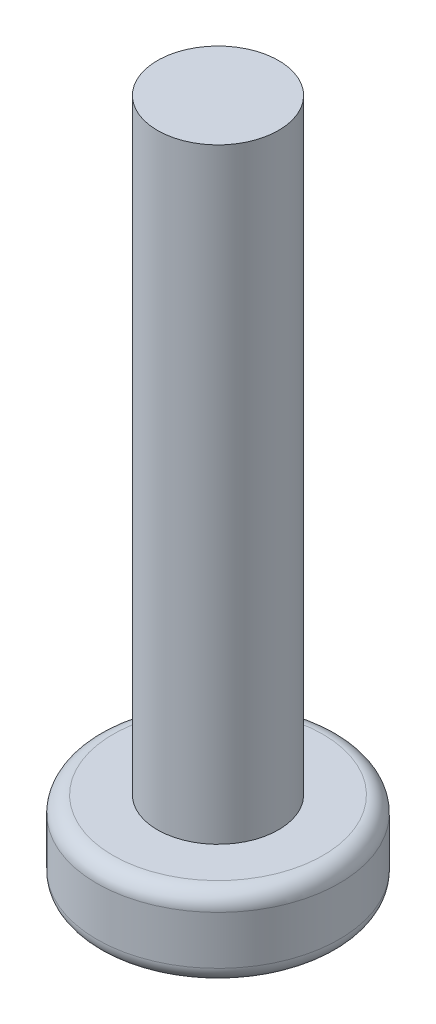
ISO-10303-21;
HEADER;
FILE_DESCRIPTION(('STEP AP214'),'2;1');
FILE_NAME('part.step','',(''),(''),'','','');
FILE_SCHEMA(('AUTOMOTIVE_DESIGN { 1 0 10303 214 1 1 1 1 }'));
ENDSEC;
DATA;
#1=APPLICATION_CONTEXT('core data for automotive mechanical design processes');
#2=APPLICATION_PROTOCOL_DEFINITION('international standard','automotive_design',2000,#1);
#3=PRODUCT_CONTEXT('',#1,'mechanical');
#4=PRODUCT('Part','Part','',(#3));
#5=PRODUCT_RELATED_PRODUCT_CATEGORY('part','',(#4));
#6=PRODUCT_DEFINITION_FORMATION('','',#4);
#7=PRODUCT_DEFINITION_CONTEXT('part definition',#1,'design');
#8=PRODUCT_DEFINITION('design','',#6,#7);
#9=PRODUCT_DEFINITION_SHAPE('','',#8);
#10=(LENGTH_UNIT() NAMED_UNIT(*) SI_UNIT(.MILLI.,.METRE.));
#11=(NAMED_UNIT(*) PLANE_ANGLE_UNIT() SI_UNIT($,.RADIAN.));
#12=(NAMED_UNIT(*) SI_UNIT($,.STERADIAN.) SOLID_ANGLE_UNIT());
#13=UNCERTAINTY_MEASURE_WITH_UNIT(LENGTH_MEASURE(1.E-05),#10,'distance_accuracy_value','');
#14=(GEOMETRIC_REPRESENTATION_CONTEXT(3) GLOBAL_UNCERTAINTY_ASSIGNED_CONTEXT((#13)) GLOBAL_UNIT_ASSIGNED_CONTEXT((#10,
#11,#12)) REPRESENTATION_CONTEXT('',''));
#15=CARTESIAN_POINT('',(0.,0.,0.));
#16=DIRECTION('',(0.,0.,1.));
#17=DIRECTION('',(1.,0.,0.));
#18=AXIS2_PLACEMENT_3D('',#15,#16,#17);
#19=CARTESIAN_POINT('',(0.,2.,0.));
#20=DIRECTION('',(0.,1.,0.));
#21=DIRECTION('',(0.,0.,1.));
#22=AXIS2_PLACEMENT_3D('',#19,#20,#21);
#23=PLANE('',#22);
#24=CARTESIAN_POINT('',(0.,2.,0.));
#25=DIRECTION('',(0.,1.,0.));
#26=DIRECTION('',(0.,0.,1.));
#27=AXIS2_PLACEMENT_3D('',#24,#25,#26);
#28=CIRCLE('',#27,2.6);
#29=CARTESIAN_POINT('',(0.,2.,2.6));
#30=VERTEX_POINT('',#29);
#31=EDGE_CURVE('E213',#30,#30,#28,.T.);
#32=ORIENTED_EDGE('',*,*,#31,.T.);
#33=EDGE_LOOP('',(#32));
#34=FACE_BOUND('',#33,.T.);
#35=CARTESIAN_POINT('',(0.,2.,0.));
#36=DIRECTION('',(0.,1.,0.));
#37=DIRECTION('',(0.,0.,1.));
#38=AXIS2_PLACEMENT_3D('',#35,#36,#37);
#39=CIRCLE('',#38,1.5);
#40=CARTESIAN_POINT('',(0.,2.,1.5));
#41=VERTEX_POINT('',#40);
#42=EDGE_CURVE('E192',#41,#41,#39,.T.);
#43=ORIENTED_EDGE('',*,*,#42,.F.);
#44=EDGE_LOOP('',(#43));
#45=FACE_BOUND('',#44,.T.);
#46=ADVANCED_FACE('F33',(#34,#45),#23,.T.);
#47=CARTESIAN_POINT('',(0.,2.,0.));
#48=DIRECTION('',(0.,-1.,0.));
#49=DIRECTION('',(0.,0.,-1.));
#50=AXIS2_PLACEMENT_3D('',#47,#48,#49);
#51=CYLINDRICAL_SURFACE('',#50,3.);
#52=CARTESIAN_POINT('',(0.,1.6,0.));
#53=DIRECTION('',(0.,1.,0.));
#54=DIRECTION('',(0.,0.,1.));
#55=AXIS2_PLACEMENT_3D('',#52,#53,#54);
#56=CIRCLE('',#55,3.);
#57=CARTESIAN_POINT('',(0.,1.6,3.));
#58=VERTEX_POINT('',#57);
#59=EDGE_CURVE('E41',#58,#58,#56,.F.);
#60=ORIENTED_EDGE('',*,*,#59,.T.);
#61=EDGE_LOOP('',(#60));
#62=FACE_BOUND('',#61,.T.);
#63=CARTESIAN_POINT('',(0.,0.4,0.));
#64=DIRECTION('',(0.,1.,0.));
#65=DIRECTION('',(0.,0.,1.));
#66=AXIS2_PLACEMENT_3D('',#63,#64,#65);
#67=CIRCLE('',#66,3.);
#68=CARTESIAN_POINT('',(0.,0.4,3.));
#69=VERTEX_POINT('',#68);
#70=EDGE_CURVE('E218',#69,#69,#67,.T.);
#71=ORIENTED_EDGE('',*,*,#70,.T.);
#72=EDGE_LOOP('',(#71));
#73=FACE_BOUND('',#72,.T.);
#74=ADVANCED_FACE('F223',(#62,#73),#51,.T.);
#75=CARTESIAN_POINT('',(0.,0.,0.));
#76=DIRECTION('',(0.,1.,0.));
#77=DIRECTION('',(0.,0.,1.));
#78=AXIS2_PLACEMENT_3D('',#75,#76,#77);
#79=PLANE('',#78);
#80=CARTESIAN_POINT('',(0.,0.,0.));
#81=DIRECTION('',(0.,1.,0.));
#82=DIRECTION('',(0.,0.,1.));
#83=AXIS2_PLACEMENT_3D('',#80,#81,#82);
#84=CIRCLE('',#83,2.6);
#85=CARTESIAN_POINT('',(0.,0.,2.6));
#86=VERTEX_POINT('',#85);
#87=EDGE_CURVE('E11',#86,#86,#84,.F.);
#88=ORIENTED_EDGE('',*,*,#87,.T.);
#89=EDGE_LOOP('',(#88));
#90=FACE_BOUND('',#89,.T.);
#91=DIRECTION('',(1.,0.,0.));
#92=VECTOR('',#91,1.);
#93=CARTESIAN_POINT('',(0.,0.,0.45));
#94=LINE('',#93,#92);
#95=CARTESIAN_POINT('',(-1.5,0.,0.45));
#96=VERTEX_POINT('',#95);
#97=CARTESIAN_POINT('',(-0.45,0.,0.45));
#98=VERTEX_POINT('',#97);
#99=EDGE_CURVE('E160',#96,#98,#94,.T.);
#100=ORIENTED_EDGE('',*,*,#99,.T.);
#101=DIRECTION('',(0.,0.,-1.));
#102=VECTOR('',#101,1.);
#103=CARTESIAN_POINT('',(-0.45,0.,0.));
#104=LINE('',#103,#102);
#105=CARTESIAN_POINT('',(-0.45,0.,1.5));
#106=VERTEX_POINT('',#105);
#107=EDGE_CURVE('E48',#106,#98,#104,.T.);
#108=ORIENTED_EDGE('',*,*,#107,.F.);
#109=DIRECTION('',(1.,0.,0.));
#110=VECTOR('',#109,1.);
#111=CARTESIAN_POINT('',(0.,0.,1.5));
#112=LINE('',#111,#110);
#113=CARTESIAN_POINT('',(0.45,0.,1.5));
#114=VERTEX_POINT('',#113);
#115=EDGE_CURVE('E187',#106,#114,#112,.T.);
#116=ORIENTED_EDGE('',*,*,#115,.T.);
#117=DIRECTION('',(0.,0.,-1.));
#118=VECTOR('',#117,1.);
#119=CARTESIAN_POINT('',(0.45,0.,0.));
#120=LINE('',#119,#118);
#121=CARTESIAN_POINT('',(0.45,0.,0.45));
#122=VERTEX_POINT('',#121);
#123=EDGE_CURVE('E185',#114,#122,#120,.T.);
#124=ORIENTED_EDGE('',*,*,#123,.T.);
#125=DIRECTION('',(1.,0.,0.));
#126=VECTOR('',#125,1.);
#127=CARTESIAN_POINT('',(0.,0.,0.45));
#128=LINE('',#127,#126);
#129=CARTESIAN_POINT('',(1.5,0.,0.45));
#130=VERTEX_POINT('',#129);
#131=EDGE_CURVE('E143',#122,#130,#128,.T.);
#132=ORIENTED_EDGE('',*,*,#131,.T.);
#133=DIRECTION('',(0.,0.,-1.));
#134=VECTOR('',#133,1.);
#135=CARTESIAN_POINT('',(1.5,0.,0.));
#136=LINE('',#135,#134);
#137=CARTESIAN_POINT('',(1.5,0.,-0.45));
#138=VERTEX_POINT('',#137);
#139=EDGE_CURVE('E181',#130,#138,#136,.T.);
#140=ORIENTED_EDGE('',*,*,#139,.T.);
#141=DIRECTION('',(1.,0.,0.));
#142=VECTOR('',#141,1.);
#143=CARTESIAN_POINT('',(0.,0.,-0.45));
#144=LINE('',#143,#142);
#145=CARTESIAN_POINT('',(0.45,0.,-0.45));
#146=VERTEX_POINT('',#145);
#147=EDGE_CURVE('E178',#146,#138,#144,.T.);
#148=ORIENTED_EDGE('',*,*,#147,.F.);
#149=DIRECTION('',(0.,0.,-1.));
#150=VECTOR('',#149,1.);
#151=CARTESIAN_POINT('',(0.45,0.,0.));
#152=LINE('',#151,#150);
#153=CARTESIAN_POINT('',(0.45,0.,-1.5));
#154=VERTEX_POINT('',#153);
#155=EDGE_CURVE('E175',#146,#154,#152,.T.);
#156=ORIENTED_EDGE('',*,*,#155,.T.);
#157=DIRECTION('',(1.,0.,0.));
#158=VECTOR('',#157,1.);
#159=CARTESIAN_POINT('',(0.,0.,-1.5));
#160=LINE('',#159,#158);
#161=CARTESIAN_POINT('',(-0.45,0.,-1.5));
#162=VERTEX_POINT('',#161);
#163=EDGE_CURVE('E172',#162,#154,#160,.T.);
#164=ORIENTED_EDGE('',*,*,#163,.F.);
#165=DIRECTION('',(0.,0.,-1.));
#166=VECTOR('',#165,1.);
#167=CARTESIAN_POINT('',(-0.45,0.,0.));
#168=LINE('',#167,#166);
#169=CARTESIAN_POINT('',(-0.45,0.,-0.45));
#170=VERTEX_POINT('',#169);
#171=EDGE_CURVE('E169',#170,#162,#168,.T.);
#172=ORIENTED_EDGE('',*,*,#171,.F.);
#173=DIRECTION('',(1.,0.,0.));
#174=VECTOR('',#173,1.);
#175=CARTESIAN_POINT('',(0.,0.,-0.45));
#176=LINE('',#175,#174);
#177=CARTESIAN_POINT('',(-1.5,0.,-0.45));
#178=VERTEX_POINT('',#177);
#179=EDGE_CURVE('E166',#178,#170,#176,.T.);
#180=ORIENTED_EDGE('',*,*,#179,.F.);
#181=DIRECTION('',(0.,0.,-1.));
#182=VECTOR('',#181,1.);
#183=CARTESIAN_POINT('',(-1.5,0.,0.));
#184=LINE('',#183,#182);
#185=EDGE_CURVE('E163',#96,#178,#184,.T.);
#186=ORIENTED_EDGE('',*,*,#185,.F.);
#187=EDGE_LOOP('',(#100,#108,#116,#124,#132,#140,#148,#156,#164,#172,#180,#186));
#188=FACE_BOUND('',#187,.T.);
#189=ADVANCED_FACE('F239',(#90,#188),#79,.F.);
#190=CARTESIAN_POINT('',(0.,17.,0.));
#191=DIRECTION('',(0.,-1.,0.));
#192=DIRECTION('',(0.,0.,-1.));
#193=AXIS2_PLACEMENT_3D('',#190,#191,#192);
#194=CYLINDRICAL_SURFACE('',#193,1.5);
#195=CARTESIAN_POINT('',(0.,17.,0.));
#196=DIRECTION('',(0.,1.,0.));
#197=DIRECTION('',(0.,0.,1.));
#198=AXIS2_PLACEMENT_3D('',#195,#196,#197);
#199=CIRCLE('',#198,1.5);
#200=CARTESIAN_POINT('',(0.,17.,1.5));
#201=VERTEX_POINT('',#200);
#202=EDGE_CURVE('E210',#201,#201,#199,.T.);
#203=ORIENTED_EDGE('',*,*,#202,.F.);
#204=EDGE_LOOP('',(#203));
#205=FACE_BOUND('',#204,.T.);
#206=ORIENTED_EDGE('',*,*,#42,.T.);
#207=EDGE_LOOP('',(#206));
#208=FACE_BOUND('',#207,.T.);
#209=ADVANCED_FACE('F236',(#205,#208),#194,.T.);
#210=CARTESIAN_POINT('',(0.,17.,0.));
#211=DIRECTION('',(0.,1.,0.));
#212=DIRECTION('',(0.,0.,1.));
#213=AXIS2_PLACEMENT_3D('',#210,#211,#212);
#214=PLANE('',#213);
#215=ORIENTED_EDGE('',*,*,#202,.T.);
#216=EDGE_LOOP('',(#215));
#217=FACE_BOUND('',#216,.T.);
#218=ADVANCED_FACE('F238',(#217),#214,.T.);
#219=CARTESIAN_POINT('',(-0.45,1.9,0.));
#220=DIRECTION('',(-1.,0.,0.));
#221=DIRECTION('',(0.,0.,1.));
#222=AXIS2_PLACEMENT_3D('',#219,#220,#221);
#223=PLANE('',#222);
#224=ORIENTED_EDGE('',*,*,#107,.T.);
#225=DIRECTION('',(0.,-1.,0.));
#226=VECTOR('',#225,1.);
#227=CARTESIAN_POINT('',(-0.45,1.9,0.45));
#228=LINE('',#227,#226);
#229=CARTESIAN_POINT('',(-0.45,1.9,0.45));
#230=VERTEX_POINT('',#229);
#231=EDGE_CURVE('E158',#230,#98,#228,.T.);
#232=ORIENTED_EDGE('',*,*,#231,.F.);
#233=DIRECTION('',(0.,0.,-1.));
#234=VECTOR('',#233,1.);
#235=CARTESIAN_POINT('',(-0.45,1.9,0.));
#236=LINE('',#235,#234);
#237=CARTESIAN_POINT('',(-0.45,1.9,1.5));
#238=VERTEX_POINT('',#237);
#239=EDGE_CURVE('E190',#238,#230,#236,.T.);
#240=ORIENTED_EDGE('',*,*,#239,.F.);
#241=DIRECTION('',(0.,-1.,0.));
#242=VECTOR('',#241,1.);
#243=CARTESIAN_POINT('',(-0.45,1.9,1.5));
#244=LINE('',#243,#242);
#245=EDGE_CURVE('E56',#238,#106,#244,.T.);
#246=ORIENTED_EDGE('',*,*,#245,.T.);
#247=EDGE_LOOP('',(#224,#232,#240,#246));
#248=FACE_BOUND('',#247,.T.);
#249=ADVANCED_FACE('F246',(#248),#223,.F.);
#250=CARTESIAN_POINT('',(0.,1.9,1.5));
#251=DIRECTION('',(0.,0.,-1.));
#252=DIRECTION('',(-1.,0.,0.));
#253=AXIS2_PLACEMENT_3D('',#250,#251,#252);
#254=PLANE('',#253);
#255=ORIENTED_EDGE('',*,*,#115,.F.);
#256=ORIENTED_EDGE('',*,*,#245,.F.);
#257=DIRECTION('',(1.,0.,0.));
#258=VECTOR('',#257,1.);
#259=CARTESIAN_POINT('',(0.,1.9,1.5));
#260=LINE('',#259,#258);
#261=CARTESIAN_POINT('',(0.45,1.9,1.5));
#262=VERTEX_POINT('',#261);
#263=EDGE_CURVE('E136',#238,#262,#260,.T.);
#264=ORIENTED_EDGE('',*,*,#263,.T.);
#265=DIRECTION('',(0.,-1.,0.));
#266=VECTOR('',#265,1.);
#267=CARTESIAN_POINT('',(0.45,1.9,1.5));
#268=LINE('',#267,#266);
#269=EDGE_CURVE('E133',#262,#114,#268,.T.);
#270=ORIENTED_EDGE('',*,*,#269,.T.);
#271=EDGE_LOOP('',(#255,#256,#264,#270));
#272=FACE_BOUND('',#271,.T.);
#273=ADVANCED_FACE('F319',(#272),#254,.T.);
#274=CARTESIAN_POINT('',(0.45,1.9,0.));
#275=DIRECTION('',(-1.,0.,0.));
#276=DIRECTION('',(0.,0.,1.));
#277=AXIS2_PLACEMENT_3D('',#274,#275,#276);
#278=PLANE('',#277);
#279=ORIENTED_EDGE('',*,*,#123,.F.);
#280=ORIENTED_EDGE('',*,*,#269,.F.);
#281=DIRECTION('',(0.,0.,-1.));
#282=VECTOR('',#281,1.);
#283=CARTESIAN_POINT('',(0.45,1.9,0.));
#284=LINE('',#283,#282);
#285=CARTESIAN_POINT('',(0.45,1.9,0.45));
#286=VERTEX_POINT('',#285);
#287=EDGE_CURVE('E127',#262,#286,#284,.T.);
#288=ORIENTED_EDGE('',*,*,#287,.T.);
#289=DIRECTION('',(0.,-1.,0.));
#290=VECTOR('',#289,1.);
#291=CARTESIAN_POINT('',(0.45,1.9,0.45));
#292=LINE('',#291,#290);
#293=EDGE_CURVE('E131',#286,#122,#292,.T.);
#294=ORIENTED_EDGE('',*,*,#293,.T.);
#295=EDGE_LOOP('',(#279,#280,#288,#294));
#296=FACE_BOUND('',#295,.T.);
#297=ADVANCED_FACE('F130',(#296),#278,.T.);
#298=CARTESIAN_POINT('',(0.,1.9,0.45));
#299=DIRECTION('',(0.,0.,-1.));
#300=DIRECTION('',(-1.,0.,0.));
#301=AXIS2_PLACEMENT_3D('',#298,#299,#300);
#302=PLANE('',#301);
#303=ORIENTED_EDGE('',*,*,#131,.F.);
#304=ORIENTED_EDGE('',*,*,#293,.F.);
#305=DIRECTION('',(1.,0.,0.));
#306=VECTOR('',#305,1.);
#307=CARTESIAN_POINT('',(0.,1.9,0.45));
#308=LINE('',#307,#306);
#309=CARTESIAN_POINT('',(1.5,1.9,0.45));
#310=VERTEX_POINT('',#309);
#311=EDGE_CURVE('E137',#286,#310,#308,.T.);
#312=ORIENTED_EDGE('',*,*,#311,.T.);
#313=DIRECTION('',(0.,-1.,0.));
#314=VECTOR('',#313,1.);
#315=CARTESIAN_POINT('',(1.5,1.9,0.45));
#316=LINE('',#315,#314);
#317=EDGE_CURVE('E145',#310,#130,#316,.T.);
#318=ORIENTED_EDGE('',*,*,#317,.T.);
#319=EDGE_LOOP('',(#303,#304,#312,#318));
#320=FACE_BOUND('',#319,.T.);
#321=ADVANCED_FACE('F140',(#320),#302,.T.);
#322=CARTESIAN_POINT('',(1.5,1.9,0.));
#323=DIRECTION('',(-1.,0.,0.));
#324=DIRECTION('',(0.,0.,1.));
#325=AXIS2_PLACEMENT_3D('',#322,#323,#324);
#326=PLANE('',#325);
#327=ORIENTED_EDGE('',*,*,#139,.F.);
#328=ORIENTED_EDGE('',*,*,#317,.F.);
#329=DIRECTION('',(0.,0.,-1.));
#330=VECTOR('',#329,1.);
#331=CARTESIAN_POINT('',(1.5,1.9,0.));
#332=LINE('',#331,#330);
#333=CARTESIAN_POINT('',(1.5,1.9,-0.45));
#334=VERTEX_POINT('',#333);
#335=EDGE_CURVE('E151',#310,#334,#332,.T.);
#336=ORIENTED_EDGE('',*,*,#335,.T.);
#337=DIRECTION('',(0.,-1.,0.));
#338=VECTOR('',#337,1.);
#339=CARTESIAN_POINT('',(1.5,1.9,-0.45));
#340=LINE('',#339,#338);
#341=EDGE_CURVE('E195',#334,#138,#340,.T.);
#342=ORIENTED_EDGE('',*,*,#341,.T.);
#343=EDGE_LOOP('',(#327,#328,#336,#342));
#344=FACE_BOUND('',#343,.T.);
#345=ADVANCED_FACE('F318',(#344),#326,.T.);
#346=CARTESIAN_POINT('',(0.,1.9,-0.45));
#347=DIRECTION('',(0.,0.,-1.));
#348=DIRECTION('',(-1.,0.,0.));
#349=AXIS2_PLACEMENT_3D('',#346,#347,#348);
#350=PLANE('',#349);
#351=ORIENTED_EDGE('',*,*,#147,.T.);
#352=ORIENTED_EDGE('',*,*,#341,.F.);
#353=DIRECTION('',(1.,0.,0.));
#354=VECTOR('',#353,1.);
#355=CARTESIAN_POINT('',(0.,1.9,-0.45));
#356=LINE('',#355,#354);
#357=CARTESIAN_POINT('',(0.45,1.9,-0.45));
#358=VERTEX_POINT('',#357);
#359=EDGE_CURVE('E153',#358,#334,#356,.T.);
#360=ORIENTED_EDGE('',*,*,#359,.F.);
#361=DIRECTION('',(0.,-1.,0.));
#362=VECTOR('',#361,1.);
#363=CARTESIAN_POINT('',(0.45,1.9,-0.45));
#364=LINE('',#363,#362);
#365=EDGE_CURVE('E197',#358,#146,#364,.T.);
#366=ORIENTED_EDGE('',*,*,#365,.T.);
#367=EDGE_LOOP('',(#351,#352,#360,#366));
#368=FACE_BOUND('',#367,.T.);
#369=ADVANCED_FACE('F313',(#368),#350,.F.);
#370=CARTESIAN_POINT('',(0.45,1.9,0.));
#371=DIRECTION('',(-1.,0.,0.));
#372=DIRECTION('',(0.,0.,1.));
#373=AXIS2_PLACEMENT_3D('',#370,#371,#372);
#374=PLANE('',#373);
#375=ORIENTED_EDGE('',*,*,#155,.F.);
#376=ORIENTED_EDGE('',*,*,#365,.F.);
#377=DIRECTION('',(0.,0.,-1.));
#378=VECTOR('',#377,1.);
#379=CARTESIAN_POINT('',(0.45,1.9,0.));
#380=LINE('',#379,#378);
#381=CARTESIAN_POINT('',(0.45,1.9,-1.5));
#382=VERTEX_POINT('',#381);
#383=EDGE_CURVE('E308',#358,#382,#380,.T.);
#384=ORIENTED_EDGE('',*,*,#383,.T.);
#385=DIRECTION('',(0.,-1.,0.));
#386=VECTOR('',#385,1.);
#387=CARTESIAN_POINT('',(0.45,1.9,-1.5));
#388=LINE('',#387,#386);
#389=EDGE_CURVE('E199',#382,#154,#388,.T.);
#390=ORIENTED_EDGE('',*,*,#389,.T.);
#391=EDGE_LOOP('',(#375,#376,#384,#390));
#392=FACE_BOUND('',#391,.T.);
#393=ADVANCED_FACE('F335',(#392),#374,.T.);
#394=CARTESIAN_POINT('',(0.,1.9,-1.5));
#395=DIRECTION('',(0.,0.,-1.));
#396=DIRECTION('',(-1.,0.,0.));
#397=AXIS2_PLACEMENT_3D('',#394,#395,#396);
#398=PLANE('',#397);
#399=ORIENTED_EDGE('',*,*,#163,.T.);
#400=ORIENTED_EDGE('',*,*,#389,.F.);
#401=DIRECTION('',(1.,0.,0.));
#402=VECTOR('',#401,1.);
#403=CARTESIAN_POINT('',(0.,1.9,-1.5));
#404=LINE('',#403,#402);
#405=CARTESIAN_POINT('',(-0.45,1.9,-1.5));
#406=VERTEX_POINT('',#405);
#407=EDGE_CURVE('E305',#406,#382,#404,.T.);
#408=ORIENTED_EDGE('',*,*,#407,.F.);
#409=DIRECTION('',(0.,-1.,0.));
#410=VECTOR('',#409,1.);
#411=CARTESIAN_POINT('',(-0.45,1.9,-1.5));
#412=LINE('',#411,#410);
#413=EDGE_CURVE('E201',#406,#162,#412,.T.);
#414=ORIENTED_EDGE('',*,*,#413,.T.);
#415=EDGE_LOOP('',(#399,#400,#408,#414));
#416=FACE_BOUND('',#415,.T.);
#417=ADVANCED_FACE('F338',(#416),#398,.F.);
#418=CARTESIAN_POINT('',(-0.45,1.9,0.));
#419=DIRECTION('',(-1.,0.,0.));
#420=DIRECTION('',(0.,0.,1.));
#421=AXIS2_PLACEMENT_3D('',#418,#419,#420);
#422=PLANE('',#421);
#423=ORIENTED_EDGE('',*,*,#171,.T.);
#424=ORIENTED_EDGE('',*,*,#413,.F.);
#425=DIRECTION('',(0.,0.,-1.));
#426=VECTOR('',#425,1.);
#427=CARTESIAN_POINT('',(-0.45,1.9,0.));
#428=LINE('',#427,#426);
#429=CARTESIAN_POINT('',(-0.45,1.9,-0.45));
#430=VERTEX_POINT('',#429);
#431=EDGE_CURVE('E302',#430,#406,#428,.T.);
#432=ORIENTED_EDGE('',*,*,#431,.F.);
#433=DIRECTION('',(0.,-1.,0.));
#434=VECTOR('',#433,1.);
#435=CARTESIAN_POINT('',(-0.45,1.9,-0.45));
#436=LINE('',#435,#434);
#437=EDGE_CURVE('E203',#430,#170,#436,.T.);
#438=ORIENTED_EDGE('',*,*,#437,.T.);
#439=EDGE_LOOP('',(#423,#424,#432,#438));
#440=FACE_BOUND('',#439,.T.);
#441=ADVANCED_FACE('F342',(#440),#422,.F.);
#442=CARTESIAN_POINT('',(0.,1.9,-0.45));
#443=DIRECTION('',(0.,0.,-1.));
#444=DIRECTION('',(-1.,0.,0.));
#445=AXIS2_PLACEMENT_3D('',#442,#443,#444);
#446=PLANE('',#445);
#447=ORIENTED_EDGE('',*,*,#179,.T.);
#448=ORIENTED_EDGE('',*,*,#437,.F.);
#449=DIRECTION('',(1.,0.,0.));
#450=VECTOR('',#449,1.);
#451=CARTESIAN_POINT('',(0.,1.9,-0.45));
#452=LINE('',#451,#450);
#453=CARTESIAN_POINT('',(-1.5,1.9,-0.45));
#454=VERTEX_POINT('',#453);
#455=EDGE_CURVE('E299',#454,#430,#452,.T.);
#456=ORIENTED_EDGE('',*,*,#455,.F.);
#457=DIRECTION('',(0.,-1.,0.));
#458=VECTOR('',#457,1.);
#459=CARTESIAN_POINT('',(-1.5,1.9,-0.45));
#460=LINE('',#459,#458);
#461=EDGE_CURVE('E205',#454,#178,#460,.T.);
#462=ORIENTED_EDGE('',*,*,#461,.T.);
#463=EDGE_LOOP('',(#447,#448,#456,#462));
#464=FACE_BOUND('',#463,.T.);
#465=ADVANCED_FACE('F346',(#464),#446,.F.);
#466=CARTESIAN_POINT('',(-1.5,1.9,0.));
#467=DIRECTION('',(-1.,0.,0.));
#468=DIRECTION('',(0.,0.,1.));
#469=AXIS2_PLACEMENT_3D('',#466,#467,#468);
#470=PLANE('',#469);
#471=ORIENTED_EDGE('',*,*,#185,.T.);
#472=ORIENTED_EDGE('',*,*,#461,.F.);
#473=DIRECTION('',(0.,0.,-1.));
#474=VECTOR('',#473,1.);
#475=CARTESIAN_POINT('',(-1.5,1.9,0.));
#476=LINE('',#475,#474);
#477=CARTESIAN_POINT('',(-1.5,1.9,0.45));
#478=VERTEX_POINT('',#477);
#479=EDGE_CURVE('E295',#478,#454,#476,.T.);
#480=ORIENTED_EDGE('',*,*,#479,.F.);
#481=DIRECTION('',(0.,-1.,0.));
#482=VECTOR('',#481,1.);
#483=CARTESIAN_POINT('',(-1.5,1.9,0.45));
#484=LINE('',#483,#482);
#485=EDGE_CURVE('E207',#478,#96,#484,.T.);
#486=ORIENTED_EDGE('',*,*,#485,.T.);
#487=EDGE_LOOP('',(#471,#472,#480,#486));
#488=FACE_BOUND('',#487,.T.);
#489=ADVANCED_FACE('F350',(#488),#470,.F.);
#490=CARTESIAN_POINT('',(0.,1.9,0.45));
#491=DIRECTION('',(0.,0.,-1.));
#492=DIRECTION('',(-1.,0.,0.));
#493=AXIS2_PLACEMENT_3D('',#490,#491,#492);
#494=PLANE('',#493);
#495=ORIENTED_EDGE('',*,*,#99,.F.);
#496=ORIENTED_EDGE('',*,*,#485,.F.);
#497=DIRECTION('',(1.,0.,0.));
#498=VECTOR('',#497,1.);
#499=CARTESIAN_POINT('',(0.,1.9,0.45));
#500=LINE('',#499,#498);
#501=EDGE_CURVE('E100',#478,#230,#500,.T.);
#502=ORIENTED_EDGE('',*,*,#501,.T.);
#503=ORIENTED_EDGE('',*,*,#231,.T.);
#504=EDGE_LOOP('',(#495,#496,#502,#503));
#505=FACE_BOUND('',#504,.T.);
#506=ADVANCED_FACE('F291',(#505),#494,.T.);
#507=CARTESIAN_POINT('',(0.,1.9,0.));
#508=DIRECTION('',(0.,-1.,0.));
#509=DIRECTION('',(0.,0.,-1.));
#510=AXIS2_PLACEMENT_3D('',#507,#508,#509);
#511=PLANE('',#510);
#512=ORIENTED_EDGE('',*,*,#239,.T.);
#513=ORIENTED_EDGE('',*,*,#501,.F.);
#514=ORIENTED_EDGE('',*,*,#479,.T.);
#515=ORIENTED_EDGE('',*,*,#455,.T.);
#516=ORIENTED_EDGE('',*,*,#431,.T.);
#517=ORIENTED_EDGE('',*,*,#407,.T.);
#518=ORIENTED_EDGE('',*,*,#383,.F.);
#519=ORIENTED_EDGE('',*,*,#359,.T.);
#520=ORIENTED_EDGE('',*,*,#335,.F.);
#521=ORIENTED_EDGE('',*,*,#311,.F.);
#522=ORIENTED_EDGE('',*,*,#287,.F.);
#523=ORIENTED_EDGE('',*,*,#263,.F.);
#524=EDGE_LOOP('',(#512,#513,#514,#515,#516,#517,#518,#519,#520,#521,#522,#523));
#525=FACE_BOUND('',#524,.T.);
#526=ADVANCED_FACE('F149',(#525),#511,.T.);
#527=CARTESIAN_POINT('',(0.,1.6,0.));
#528=DIRECTION('',(0.,1.,0.));
#529=DIRECTION('',(0.,0.,1.));
#530=AXIS2_PLACEMENT_3D('',#527,#528,#529);
#531=TOROIDAL_SURFACE('',#530,2.6,0.4);
#532=ORIENTED_EDGE('',*,*,#59,.F.);
#533=EDGE_LOOP('',(#532));
#534=FACE_BOUND('',#533,.T.);
#535=ORIENTED_EDGE('',*,*,#31,.F.);
#536=EDGE_LOOP('',(#535));
#537=FACE_BOUND('',#536,.T.);
#538=ADVANCED_FACE('F226',(#534,#537),#531,.T.);
#539=CARTESIAN_POINT('',(0.,0.4,0.));
#540=DIRECTION('',(0.,1.,0.));
#541=DIRECTION('',(0.,0.,1.));
#542=AXIS2_PLACEMENT_3D('',#539,#540,#541);
#543=TOROIDAL_SURFACE('',#542,2.6,0.4);
#544=ORIENTED_EDGE('',*,*,#87,.F.);
#545=EDGE_LOOP('',(#544));
#546=FACE_BOUND('',#545,.T.);
#547=ORIENTED_EDGE('',*,*,#70,.F.);
#548=EDGE_LOOP('',(#547));
#549=FACE_BOUND('',#548,.T.);
#550=ADVANCED_FACE('F35',(#546,#549),#543,.T.);
#551=CLOSED_SHELL('',(#46,#74,#189,#209,#218,#249,#273,#297,#321,#345,#369,#393,#417,#441,#465,
#489,#506,#526,#538,#550));
#552=MANIFOLD_SOLID_BREP('B2',#551);
#553=ADVANCED_BREP_SHAPE_REPRESENTATION('',(#18,#552),#14);
#554=SHAPE_DEFINITION_REPRESENTATION(#9,#553);
ENDSEC;
END-ISO-10303-21;
